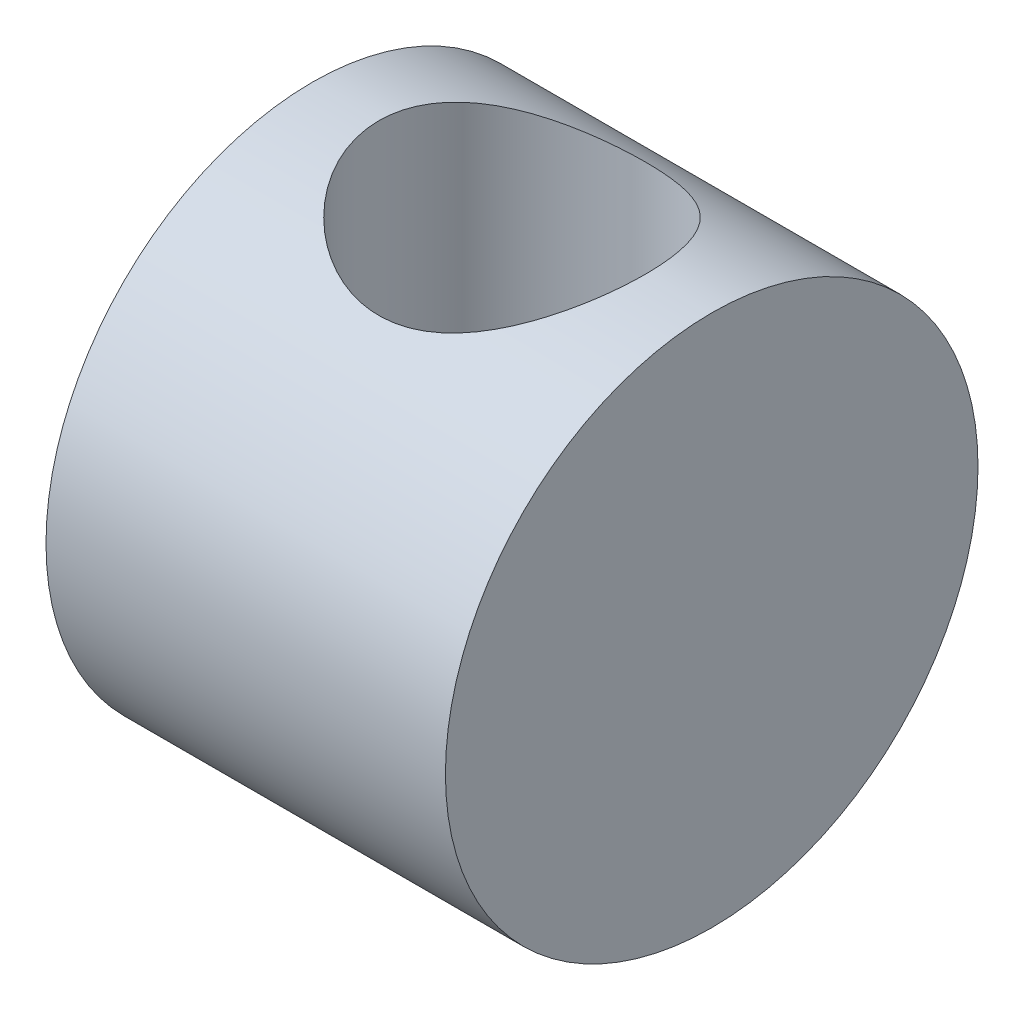
ISO-10303-21;
HEADER;
FILE_DESCRIPTION(('STEP AP214'),'2;1');
FILE_NAME('part.step','',(''),(''),'','','');
FILE_SCHEMA(('AUTOMOTIVE_DESIGN { 1 0 10303 214 1 1 1 1 }'));
ENDSEC;
DATA;
#1=APPLICATION_CONTEXT('core data for automotive mechanical design processes');
#2=APPLICATION_PROTOCOL_DEFINITION('international standard','automotive_design',2000,#1);
#3=PRODUCT_CONTEXT('',#1,'mechanical');
#4=PRODUCT('Part','Part','',(#3));
#5=PRODUCT_RELATED_PRODUCT_CATEGORY('part','',(#4));
#6=PRODUCT_DEFINITION_FORMATION('','',#4);
#7=PRODUCT_DEFINITION_CONTEXT('part definition',#1,'design');
#8=PRODUCT_DEFINITION('design','',#6,#7);
#9=PRODUCT_DEFINITION_SHAPE('','',#8);
#10=(LENGTH_UNIT() NAMED_UNIT(*) SI_UNIT(.MILLI.,.METRE.));
#11=(NAMED_UNIT(*) PLANE_ANGLE_UNIT() SI_UNIT($,.RADIAN.));
#12=(NAMED_UNIT(*) SI_UNIT($,.STERADIAN.) SOLID_ANGLE_UNIT());
#13=UNCERTAINTY_MEASURE_WITH_UNIT(LENGTH_MEASURE(1.E-05),#10,'distance_accuracy_value','');
#14=(GEOMETRIC_REPRESENTATION_CONTEXT(3) GLOBAL_UNCERTAINTY_ASSIGNED_CONTEXT((#13)) GLOBAL_UNIT_ASSIGNED_CONTEXT((#10,
#11,#12)) REPRESENTATION_CONTEXT('',''));
#15=CARTESIAN_POINT('',(0.,0.,0.));
#16=DIRECTION('',(0.,0.,1.));
#17=DIRECTION('',(1.,0.,0.));
#18=AXIS2_PLACEMENT_3D('',#15,#16,#17);
#19=CARTESIAN_POINT('',(75.,0.,0.));
#20=DIRECTION('',(-1.,0.,0.));
#21=DIRECTION('',(0.,0.,1.));
#22=AXIS2_PLACEMENT_3D('',#19,#20,#21);
#23=CYLINDRICAL_SURFACE('',#22,50.);
#24=CARTESIAN_POINT('',(75.,0.,0.));
#25=DIRECTION('',(1.,0.,0.));
#26=DIRECTION('',(0.,0.,-1.));
#27=AXIS2_PLACEMENT_3D('',#24,#25,#26);
#28=CIRCLE('',#27,50.);
#29=CARTESIAN_POINT('',(75.,0.,-50.));
#30=VERTEX_POINT('',#29);
#31=EDGE_CURVE('E10',#30,#30,#28,.T.);
#32=ORIENTED_EDGE('',*,*,#31,.F.);
#33=EDGE_LOOP('',(#32));
#34=FACE_BOUND('',#33,.T.);
#35=CARTESIAN_POINT('',(0.,0.,0.));
#36=DIRECTION('',(1.,0.,0.));
#37=DIRECTION('',(0.,0.,-1.));
#38=AXIS2_PLACEMENT_3D('',#35,#36,#37);
#39=CIRCLE('',#38,50.);
#40=CARTESIAN_POINT('',(0.,0.,-50.));
#41=VERTEX_POINT('',#40);
#42=EDGE_CURVE('E43',#41,#41,#39,.T.);
#43=ORIENTED_EDGE('',*,*,#42,.T.);
#44=EDGE_LOOP('',(#43));
#45=FACE_BOUND('',#44,.T.);
#46=CARTESIAN_POINT('',(37.5,-43.3012701892219,-25.));
#47=CARTESIAN_POINT('',(38.1516577280783,-43.3012738974014,-24.9999972492967));
#48=CARTESIAN_POINT('',(38.803371995286,-43.3160310243838,-24.9744865840936));
#49=CARTESIAN_POINT('',(40.1017786388986,-43.3745117210766,-24.8727781222585));
#50=CARTESIAN_POINT('',(40.7484685354887,-43.4182487761207,-24.7965567281536));
#51=CARTESIAN_POINT('',(42.0327286879632,-43.5331573576326,-24.594261965626));
#52=CARTESIAN_POINT('',(42.6702799970569,-43.6043791614141,-24.4680972258423));
#53=CARTESIAN_POINT('',(43.9304547154474,-43.7716876183493,-24.1675168252073));
#54=CARTESIAN_POINT('',(44.5530795491345,-43.8677718885472,-23.9931057884363));
#55=CARTESIAN_POINT('',(45.7762885876815,-44.0810172919438,-23.599020492088));
#56=CARTESIAN_POINT('',(46.3769729813867,-44.1980627806722,-23.3795936665704));
#57=CARTESIAN_POINT('',(47.5565840143935,-44.450003078188,-22.8969708071432));
#58=CARTESIAN_POINT('',(48.1355102011031,-44.584898258003,-22.6337738633895));
#59=CARTESIAN_POINT('',(49.2687683585691,-44.8687304990091,-22.0657597161742));
#60=CARTESIAN_POINT('',(49.8231060045315,-45.0176642949286,-21.7609521836511));
#61=CARTESIAN_POINT('',(50.905222067322,-45.3258294680467,-21.1115697238676));
#62=CARTESIAN_POINT('',(51.4329906242587,-45.4850646187509,-20.766980187319));
#63=CARTESIAN_POINT('',(52.5020081204318,-45.8233826320238,-20.0100786450758));
#64=CARTESIAN_POINT('',(53.0407899017115,-46.0030202537629,-19.5945268058562));
#65=CARTESIAN_POINT('',(54.0821820892583,-46.365184933611,-18.7214577237365));
#66=CARTESIAN_POINT('',(54.5847906143755,-46.5477121413885,-18.2639383011691));
#67=CARTESIAN_POINT('',(55.5517317034124,-46.9112371384387,-17.3088715339642));
#68=CARTESIAN_POINT('',(56.0160391270901,-47.0922338542696,-16.8112983153376));
#69=CARTESIAN_POINT('',(56.903358645631,-47.4481317438997,-15.778873095701));
#70=CARTESIAN_POINT('',(57.3263845601862,-47.6230349449124,-15.2440336736723));
#71=CARTESIAN_POINT('',(58.1559103346767,-47.9741176674734,-14.101935890209));
#72=CARTESIAN_POINT('',(58.559348132888,-48.1495806286941,-13.4922260925484));
#73=CARTESIAN_POINT('',(59.3130164090103,-48.4839520678333,-12.2363642027715));
#74=CARTESIAN_POINT('',(59.6632438315922,-48.6428595949776,-11.5902100209449));
#75=CARTESIAN_POINT('',(60.3068723133523,-48.9394715219822,-10.2658796175507));
#76=CARTESIAN_POINT('',(60.6003009240628,-49.0771861952305,-9.58771912093296));
#77=CARTESIAN_POINT('',(61.1271574422266,-49.3273633204677,-8.20398216536625));
#78=CARTESIAN_POINT('',(61.3605917227733,-49.4398284545107,-7.49840862763117));
#79=CARTESIAN_POINT('',(61.7500719399282,-49.6290152537626,-6.11654042575089));
#80=CARTESIAN_POINT('',(61.910441753632,-49.7077104710277,-5.44173347042514));
#81=CARTESIAN_POINT('',(62.1748266692845,-49.8380758594528,-4.07858290347346));
#82=CARTESIAN_POINT('',(62.2788442214103,-49.8897472055983,-3.39023988173991));
#83=CARTESIAN_POINT('',(62.4290995504173,-49.9645450119384,-2.0060853632284));
#84=CARTESIAN_POINT('',(62.4753667718625,-49.9876860185287,-1.31027785496802));
#85=CARTESIAN_POINT('',(62.5095715600164,-50.0047839981938,0.0831103975767497));
#86=CARTESIAN_POINT('',(62.4975126954156,-49.9987427567891,0.780691030762016));
#87=CARTESIAN_POINT('',(62.4188401315975,-49.9594597758389,2.11091341143742));
#88=CARTESIAN_POINT('',(62.3570687182852,-49.9286325703957,2.74392012544279));
#89=CARTESIAN_POINT('',(62.1857933574407,-49.8435839162395,4.00180573261866));
#90=CARTESIAN_POINT('',(62.076292770444,-49.789364114565,4.6266851948267));
#91=CARTESIAN_POINT('',(61.8107512890051,-49.6588288150231,5.86411664160767));
#92=CARTESIAN_POINT('',(61.6547088784611,-49.5825125973665,6.47666822390542));
#93=CARTESIAN_POINT('',(61.2976713405259,-49.4095616746076,7.68557846708671));
#94=CARTESIAN_POINT('',(61.0966745985519,-49.3129262397264,8.28193654550033));
#95=CARTESIAN_POINT('',(60.6485341467428,-49.1000532579772,9.46307781020892));
#96=CARTESIAN_POINT('',(60.4007934938713,-48.9835642756784,10.0475888012673));
#97=CARTESIAN_POINT('',(59.8631542092352,-48.7345249487321,11.1932924970822));
#98=CARTESIAN_POINT('',(59.573255627975,-48.6019746233258,11.7544852297725));
#99=CARTESIAN_POINT('',(58.9533967659483,-48.3236126521289,12.8510127622086));
#100=CARTESIAN_POINT('',(58.6234266116358,-48.1777977402037,13.3863411434307));
#101=CARTESIAN_POINT('',(57.9256190341222,-47.8759538475335,14.4287052512528));
#102=CARTESIAN_POINT('',(57.5577785424352,-47.7199240394887,14.9357386800821));
#103=CARTESIAN_POINT('',(56.7498172622248,-47.3857329059287,15.9659829272969));
#104=CARTESIAN_POINT('',(56.3061507663467,-47.2068738780239,16.4861908868765));
#105=CARTESIAN_POINT('',(55.378545130929,-46.845063438937,17.4878151609516));
#106=CARTESIAN_POINT('',(54.8946036999607,-46.6621117953404,17.9692292652126));
#107=CARTESIAN_POINT('',(53.8884818333071,-46.2964642917558,18.8913612335406));
#108=CARTESIAN_POINT('',(53.3662738391005,-46.1137687146198,19.3320492409618));
#109=CARTESIAN_POINT('',(52.5565544991402,-45.843593954014,19.9603840123243));
#110=CARTESIAN_POINT('',(52.2822362181157,-45.7541772399157,20.1643863204588));
#111=CARTESIAN_POINT('',(51.7249760149928,-45.5771884650087,20.5613013775411));
#112=CARTESIAN_POINT('',(51.442031409767,-45.489616992766,20.7542106211332));
#113=CARTESIAN_POINT('',(50.5443742119748,-45.2196491270857,21.3395295271279));
#114=CARTESIAN_POINT('',(49.915048704098,-45.0415831062526,21.7118230929146));
#115=CARTESIAN_POINT('',(48.6225584877746,-44.7026030694781,22.401452093898));
#116=CARTESIAN_POINT('',(47.9593967999659,-44.5416875264198,22.7187924238286));
#117=CARTESIAN_POINT('',(46.9426682570212,-44.3176563216602,23.1510609956445));
#118=CARTESIAN_POINT('',(46.6001600119892,-44.2458813176477,23.2878388705815));
#119=CARTESIAN_POINT('',(45.9083878633344,-44.1087973854835,23.5464514655133));
#120=CARTESIAN_POINT('',(45.5591257107718,-44.043486807495,23.6682900002));
#121=CARTESIAN_POINT('',(44.5020134203325,-43.8582674733307,24.0108330854159));
#122=CARTESIAN_POINT('',(43.7846445728394,-43.749027978065,24.2086472902985));
#123=CARTESIAN_POINT('',(42.3887090134456,-43.5713053774777,24.5269620029075));
#124=CARTESIAN_POINT('',(41.7115687336296,-43.5002796598521,24.6523447935619));
#125=CARTESIAN_POINT('',(40.3466934406897,-43.3894151546965,24.8469575763003));
#126=CARTESIAN_POINT('',(39.6589590285209,-43.3495746047734,24.916190741622));
#127=CARTESIAN_POINT('',(38.2794212125712,-43.3028003096564,24.9973937987513));
#128=CARTESIAN_POINT('',(37.5876205201858,-43.2958466843241,25.0093982853171));
#129=CARTESIAN_POINT('',(36.2058932942095,-43.3150972499872,24.9760435062342));
#130=CARTESIAN_POINT('',(35.5159666372643,-43.3412992028496,24.9306881126047));
#131=CARTESIAN_POINT('',(34.2194474360186,-43.4210793380396,24.7914377927162));
#132=CARTESIAN_POINT('',(33.6120075807608,-43.4713430273842,24.7034064080223));
#133=CARTESIAN_POINT('',(32.4076428039924,-43.5955661816634,24.4835158457237));
#134=CARTESIAN_POINT('',(31.8107169565193,-43.66952354879,24.3516605481936));
#135=CARTESIAN_POINT('',(30.6308400224445,-43.8388445712505,24.0455037172597));
#136=CARTESIAN_POINT('',(30.0478923896639,-43.9342134579594,23.8711918097489));
#137=CARTESIAN_POINT('',(28.8992220322171,-44.1435654387754,23.4817897713769));
#138=CARTESIAN_POINT('',(28.3335003608855,-44.2575496684739,23.2666971526418));
#139=CARTESIAN_POINT('',(27.1963689486826,-44.5066624984352,22.7866934178469));
#140=CARTESIAN_POINT('',(26.6258959734767,-44.6425228592292,22.5199449130062));
#141=CARTESIAN_POINT('',(25.5090705299555,-44.9276158962726,21.9456625079577));
#142=CARTESIAN_POINT('',(24.9627285116735,-45.0768542828119,21.6381111642824));
#143=CARTESIAN_POINT('',(23.8965059695428,-45.3849587766745,20.9841879069052));
#144=CARTESIAN_POINT('',(23.3766307737208,-45.5438268085479,20.6378082212681));
#145=CARTESIAN_POINT('',(22.3654120849964,-45.8674857084529,19.9081156666699));
#146=CARTESIAN_POINT('',(21.874070627864,-46.0322769977309,19.5248001676595));
#147=CARTESIAN_POINT('',(20.8616989877569,-46.3851314469512,18.6723933753344));
#148=CARTESIAN_POINT('',(20.3447428254896,-46.573507868278,18.1985814957771));
#149=CARTESIAN_POINT('',(19.3520387322257,-46.9482395083491,17.208801457832));
#150=CARTESIAN_POINT('',(18.8762939785701,-47.1345945702822,16.6928300549538));
#151=CARTESIAN_POINT('',(17.9686174572794,-47.500551032776,15.6210867099589));
#152=CARTESIAN_POINT('',(17.5367011798194,-47.6801500315453,15.0653008138923));
#153=CARTESIAN_POINT('',(16.71978349862,-48.0279167170746,13.9168654136766));
#154=CARTESIAN_POINT('',(16.3347816332774,-48.1960845163019,13.324216272321));
#155=CARTESIAN_POINT('',(15.6051614835791,-48.5208655173557,12.0890056860871));
#156=CARTESIAN_POINT('',(15.2618859333067,-48.6770536851778,11.445537083859));
#157=CARTESIAN_POINT('',(14.6313225332882,-48.9683386405048,10.1270695634352));
#158=CARTESIAN_POINT('',(14.3440365599551,-49.1034347211076,9.45206958944887));
#159=CARTESIAN_POINT('',(13.8289190530291,-49.3484422850348,8.07584855033877));
#160=CARTESIAN_POINT('',(13.6010450481311,-49.4583717521001,7.3746466282172));
#161=CARTESIAN_POINT('',(13.2074523325325,-49.6497556882263,5.9512332801707));
#162=CARTESIAN_POINT('',(13.041726251363,-49.7312135338177,5.2290243565372));
#163=CARTESIAN_POINT('',(12.7870261729531,-49.8569959046632,3.83701251064258));
#164=CARTESIAN_POINT('',(12.6924033315753,-49.9040426202125,3.16848428122955));
#165=CARTESIAN_POINT('',(12.5575332527149,-49.9712236366136,1.82462999197065));
#166=CARTESIAN_POINT('',(12.5172825642458,-49.9913596454803,1.14930436629496));
#167=CARTESIAN_POINT('',(12.4916837635048,-50.0041574921416,-0.202439854909058));
#168=CARTESIAN_POINT('',(12.5063192941496,-49.996827515296,-0.878858064769204));
#169=CARTESIAN_POINT('',(12.5902641777621,-49.954915747023,-2.22742891911759));
#170=CARTESIAN_POINT('',(12.6595720256024,-49.9203347058167,-2.89958168052));
#171=CARTESIAN_POINT('',(12.8456001975214,-49.8280383988319,-4.19012849545484));
#172=CARTESIAN_POINT('',(12.9588883942171,-49.7720011161012,-4.80914210853196));
#173=CARTESIAN_POINT('',(13.2311437647007,-49.638325111347,-6.03461366863557));
#174=CARTESIAN_POINT('',(13.390108359697,-49.5606876088334,-6.64107232241653));
#175=CARTESIAN_POINT('',(13.752150005338,-49.3855777801893,-7.83775931737803));
#176=CARTESIAN_POINT('',(13.9552304852864,-49.2881039121362,-8.42798639279269));
#177=CARTESIAN_POINT('',(14.4036602637829,-49.0754720301766,-9.5888648262004));
#178=CARTESIAN_POINT('',(14.6490115350773,-48.9603131909529,-10.1595152690755));
#179=CARTESIAN_POINT('',(15.191340635116,-48.7095065616211,-11.3022392748832));
#180=CARTESIAN_POINT('',(15.4900762338169,-48.5731936311759,-11.8733321215653));
#181=CARTESIAN_POINT('',(16.1290248273622,-48.2870272685357,-12.9882367601858));
#182=CARTESIAN_POINT('',(16.469238598444,-48.1371735829479,-13.5320480412983));
#183=CARTESIAN_POINT('',(17.1889854959147,-47.82710328795,-14.5901418631954));
#184=CARTESIAN_POINT('',(17.5685321170351,-47.6668831290299,-15.1044141747537));
#185=CARTESIAN_POINT('',(18.364673133882,-47.3395085084327,-16.1011229628171));
#186=CARTESIAN_POINT('',(18.7812708740803,-47.1723534214926,-16.5835565584941));
#187=CARTESIAN_POINT('',(19.6926539441099,-46.8178193567662,-17.5609868614201));
#188=CARTESIAN_POINT('',(20.1910942188869,-46.630083800416,-18.0524521311882));
#189=CARTESIAN_POINT('',(21.2275885147761,-46.2553556901095,-18.9920498989603));
#190=CARTESIAN_POINT('',(21.7656454384637,-46.0683631916544,-19.4401792163128));
#191=CARTESIAN_POINT('',(22.8792214076898,-45.7000088573962,-20.2909910624585));
#192=CARTESIAN_POINT('',(23.4547747865264,-45.5186524130989,-20.6936309903305));
#193=CARTESIAN_POINT('',(24.640212274829,-45.1669568158024,-21.4504110417563));
#194=CARTESIAN_POINT('',(25.2500937497663,-44.9966168194903,-21.8045548800276));
#195=CARTESIAN_POINT('',(26.1981392814772,-44.7508086460529,-22.3024856266454));
#196=CARTESIAN_POINT('',(26.5249666879001,-44.6693211671637,-22.4651334968817));
#197=CARTESIAN_POINT('',(27.1863570276082,-44.5114376206163,-22.7763547859923));
#198=CARTESIAN_POINT('',(27.5209181550612,-44.4350403802383,-22.9249314500231));
#199=CARTESIAN_POINT('',(28.5357385547778,-44.2145039056118,-23.3490772961765));
#200=CARTESIAN_POINT('',(29.2271164048667,-44.0790247669708,-23.6030526309905));
#201=CARTESIAN_POINT('',(30.6320570638723,-43.8370978970742,-24.0493909122374));
#202=CARTESIAN_POINT('',(31.3455486397945,-43.7305659487763,-24.2419328799137));
#203=CARTESIAN_POINT('',(32.7904560509093,-43.5507401419656,-24.5635340961408));
#204=CARTESIAN_POINT('',(33.5218589771479,-43.4774230473757,-24.6926377295426));
#205=CARTESIAN_POINT('',(34.794990170201,-43.3823768905292,-24.8591156657607));
#206=CARTESIAN_POINT('',(35.3341211493919,-43.3520358806036,-24.91189663269));
#207=CARTESIAN_POINT('',(36.4154882316478,-43.3114803138654,-24.9823411189456));
#208=CARTESIAN_POINT('',(36.9577245400057,-43.301267103469,-25.0000022889913));
#209=CARTESIAN_POINT('',(37.5,-43.3012701892219,-25.));
#210=B_SPLINE_CURVE_WITH_KNOTS('',3,(#46,#47,#48,#49,#50,#51,#52,#53,#54,#55,#56,#57,#58,#59,
#60,#61,#62,#63,#64,#65,#66,#67,#68,#69,#70,#71,#72,#73,#74,#75,#76,#77,#78,#79,#80,#81,#82,#83,
#84,#85,#86,#87,#88,#89,#90,#91,#92,#93,#94,#95,#96,#97,#98,#99,#100,#101,#102,#103,#104,#105,
#106,#107,#108,#109,#110,#111,#112,#113,#114,#115,#116,#117,#118,#119,#120,#121,#122,#123,#124,
#125,#126,#127,#128,#129,#130,#131,#132,#133,#134,#135,#136,#137,#138,#139,#140,#141,#142,#143,
#144,#145,#146,#147,#148,#149,#150,#151,#152,#153,#154,#155,#156,#157,#158,#159,#160,#161,#162,
#163,#164,#165,#166,#167,#168,#169,#170,#171,#172,#173,#174,#175,#176,#177,#178,#179,#180,#181,
#182,#183,#184,#185,#186,#187,#188,#189,#190,#191,#192,#193,#194,#195,#196,#197,#198,#199,#200,
#201,#202,#203,#204,#205,#206,#207,#208,#209),.UNSPECIFIED.,.T.,.F.,(4,2,2,2,2,2,2,2,2,2,2,2,2,
2,2,2,2,2,2,2,2,2,2,2,2,2,2,2,2,2,2,2,2,2,2,2,2,2,2,2,2,2,2,2,2,2,2,2,2,2,2,2,2,2,2,2,2,2,2,2,2,
2,2,2,2,2,2,2,2,2,2,2,2,2,2,2,2,2,2,2,2,4),(0.,1.95441192278272,3.90973393836879,
5.86864987236744,7.82737812256329,9.7756153845597,11.723893149394,13.6717188730885,
15.620262192923,17.7292201070748,19.8382876161037,21.9487286473746,24.0584607311283,
26.3111473362998,28.5639632414418,30.8156836143288,33.067164691916,35.1584826548101,
37.2497096806103,39.339870037992,41.4299025102114,43.3379272290007,45.2458176284876,
47.153770184371,49.0617912774174,50.9960675392925,52.9303414839626,54.8650930001225,
56.8000014052271,58.9178481891629,61.035815549757,63.1553234931732,64.2151556831173,
65.2753209551758,67.5299925667647,69.7844632493247,70.9112804180446,72.0378092573375,
74.2902273803598,76.3642610710996,78.438177541809,80.5108401701135,82.5833628929462,
84.4287799170669,86.2740335954544,88.1197386074929,89.965556255128,91.8963352398347,
93.8279423204728,95.7599367269954,97.6920688048029,99.8679420645493,102.043982932003,
104.220790212283,106.39757607266,108.632125578475,110.866749959239,113.099772486652,
115.332530103652,117.360339064742,119.388019315274,121.415095328543,123.442115538416,
125.335316614567,127.228410825634,129.121652247157,131.014982048795,132.989197931268,
134.9634507656,136.938383204219,138.913494094206,141.085252835438,143.257170852589,
145.431106304714,147.604875143848,148.726679825932,149.848225159809,152.091379766987,
154.327936660809,156.562926503801,158.1891770497,159.815536377274),.UNSPECIFIED.);
#211=CARTESIAN_POINT('',(37.5,-43.3012701892219,-25.));
#212=VERTEX_POINT('',#211);
#213=EDGE_CURVE('E49',#212,#212,#210,.T.);
#214=ORIENTED_EDGE('',*,*,#213,.F.);
#215=EDGE_LOOP('',(#214));
#216=FACE_BOUND('',#215,.T.);
#217=CARTESIAN_POINT('',(37.5,43.3012701892219,-25.));
#218=CARTESIAN_POINT('',(36.8483422719217,43.3012738974014,-24.9999972492967));
#219=CARTESIAN_POINT('',(36.196628004714,43.3160310243838,-24.9744865840936));
#220=CARTESIAN_POINT('',(34.8982213611014,43.3745117210766,-24.8727781222585));
#221=CARTESIAN_POINT('',(34.2515314645113,43.4182487761207,-24.7965567281536));
#222=CARTESIAN_POINT('',(32.9672713120368,43.5331573576326,-24.594261965626));
#223=CARTESIAN_POINT('',(32.3297200029431,43.6043791614141,-24.4680972258423));
#224=CARTESIAN_POINT('',(31.0695452845526,43.7716876183493,-24.1675168252073));
#225=CARTESIAN_POINT('',(30.4469204508655,43.8677718885472,-23.9931057884363));
#226=CARTESIAN_POINT('',(29.2237114123185,44.0810172919438,-23.599020492088));
#227=CARTESIAN_POINT('',(28.6230270186133,44.1980627806722,-23.3795936665704));
#228=CARTESIAN_POINT('',(27.4434159856065,44.450003078188,-22.8969708071432));
#229=CARTESIAN_POINT('',(26.8644897988969,44.584898258003,-22.6337738633895));
#230=CARTESIAN_POINT('',(25.7312316414309,44.8687304990091,-22.0657597161742));
#231=CARTESIAN_POINT('',(25.1768939954685,45.0176642949286,-21.7609521836511));
#232=CARTESIAN_POINT('',(24.094777932678,45.3258294680467,-21.1115697238676));
#233=CARTESIAN_POINT('',(23.5670093757413,45.4850646187509,-20.766980187319));
#234=CARTESIAN_POINT('',(22.4979918795682,45.8233826320238,-20.0100786450758));
#235=CARTESIAN_POINT('',(21.9592100982885,46.0030202537629,-19.5945268058562));
#236=CARTESIAN_POINT('',(20.9178179107417,46.365184933611,-18.7214577237365));
#237=CARTESIAN_POINT('',(20.4152093856245,46.5477121413885,-18.2639383011691));
#238=CARTESIAN_POINT('',(19.4482682965876,46.9112371384387,-17.3088715339642));
#239=CARTESIAN_POINT('',(18.9839608729099,47.0922338542696,-16.8112983153376));
#240=CARTESIAN_POINT('',(18.096641354369,47.4481317438997,-15.778873095701));
#241=CARTESIAN_POINT('',(17.6736154398138,47.6230349449123,-15.2440336736723));
#242=CARTESIAN_POINT('',(16.8440896653232,47.9741176674734,-14.101935890209));
#243=CARTESIAN_POINT('',(16.440651867112,48.1495806286941,-13.4922260925484));
#244=CARTESIAN_POINT('',(15.6869835909897,48.4839520678333,-12.2363642027715));
#245=CARTESIAN_POINT('',(15.3367561684078,48.6428595949776,-11.5902100209449));
#246=CARTESIAN_POINT('',(14.6931276866477,48.9394715219822,-10.2658796175507));
#247=CARTESIAN_POINT('',(14.3996990759372,49.0771861952305,-9.58771912093295));
#248=CARTESIAN_POINT('',(13.8728425577734,49.3273633204677,-8.20398216536624));
#249=CARTESIAN_POINT('',(13.6394082772267,49.4398284545107,-7.49840862763115));
#250=CARTESIAN_POINT('',(13.2499280600718,49.6290152537626,-6.11654042575088));
#251=CARTESIAN_POINT('',(13.089558246368,49.7077104710277,-5.44173347042512));
#252=CARTESIAN_POINT('',(12.8251733307155,49.8380758594528,-4.07858290347344));
#253=CARTESIAN_POINT('',(12.7211557785896,49.8897472055983,-3.39023988173989));
#254=CARTESIAN_POINT('',(12.5709004495827,49.9645450119384,-2.00608536322838));
#255=CARTESIAN_POINT('',(12.5246332281375,49.9876860185287,-1.310277854968));
#256=CARTESIAN_POINT('',(12.4904284399836,50.0047839981938,0.0831103975767619));
#257=CARTESIAN_POINT('',(12.5024873045844,49.9987427567891,0.780691030762027));
#258=CARTESIAN_POINT('',(12.5811598684025,49.9594597758389,2.11091341143743));
#259=CARTESIAN_POINT('',(12.6429312817148,49.9286325703957,2.7439201254428));
#260=CARTESIAN_POINT('',(12.8142066425593,49.8435839162395,4.00180573261866));
#261=CARTESIAN_POINT('',(12.923707229556,49.789364114565,4.62668519482671));
#262=CARTESIAN_POINT('',(13.1892487109949,49.6588288150231,5.86411664160768));
#263=CARTESIAN_POINT('',(13.3452911215389,49.5825125973665,6.47666822390543));
#264=CARTESIAN_POINT('',(13.7023286594741,49.4095616746076,7.68557846708672));
#265=CARTESIAN_POINT('',(13.9033254014481,49.3129262397264,8.28193654550033));
#266=CARTESIAN_POINT('',(14.3514658532572,49.1000532579772,9.46307781020893));
#267=CARTESIAN_POINT('',(14.5992065061287,48.9835642756784,10.0475888012673));
#268=CARTESIAN_POINT('',(15.1368457907648,48.7345249487321,11.1932924970822));
#269=CARTESIAN_POINT('',(15.426744372025,48.6019746233258,11.7544852297725));
#270=CARTESIAN_POINT('',(16.0466032340517,48.3236126521289,12.8510127622086));
#271=CARTESIAN_POINT('',(16.3765733883642,48.1777977402037,13.3863411434307));
#272=CARTESIAN_POINT('',(17.0743809658778,47.8759538475335,14.4287052512528));
#273=CARTESIAN_POINT('',(17.4422214575648,47.7199240394887,14.9357386800821));
#274=CARTESIAN_POINT('',(18.2501827377752,47.3857329059286,15.965982927297));
#275=CARTESIAN_POINT('',(18.6938492336533,47.2068738780239,16.4861908868765));
#276=CARTESIAN_POINT('',(19.621454869071,46.845063438937,17.4878151609516));
#277=CARTESIAN_POINT('',(20.1053963000393,46.6621117953404,17.9692292652126));
#278=CARTESIAN_POINT('',(21.1115181666929,46.2964642917558,18.8913612335407));
#279=CARTESIAN_POINT('',(21.6337261608995,46.1137687146198,19.3320492409618));
#280=CARTESIAN_POINT('',(22.4434455008599,45.843593954014,19.9603840123244));
#281=CARTESIAN_POINT('',(22.7177637818843,45.7541772399157,20.1643863204588));
#282=CARTESIAN_POINT('',(23.2750239850072,45.5771884650087,20.5613013775411));
#283=CARTESIAN_POINT('',(23.557968590233,45.489616992766,20.7542106211332));
#284=CARTESIAN_POINT('',(24.4556257880252,45.2196491270857,21.3395295271279));
#285=CARTESIAN_POINT('',(25.084951295902,45.0415831062526,21.7118230929146));
#286=CARTESIAN_POINT('',(26.3774415122254,44.7026030694781,22.401452093898));
#287=CARTESIAN_POINT('',(27.0406032000341,44.5416875264198,22.7187924238286));
#288=CARTESIAN_POINT('',(28.0573317429788,44.3176563216602,23.1510609956445));
#289=CARTESIAN_POINT('',(28.3998399880108,44.2458813176477,23.2878388705815));
#290=CARTESIAN_POINT('',(29.0916121366656,44.1087973854835,23.5464514655133));
#291=CARTESIAN_POINT('',(29.4408742892282,44.043486807495,23.6682900002));
#292=CARTESIAN_POINT('',(30.4979865796675,43.8582674733307,24.010833085416));
#293=CARTESIAN_POINT('',(31.2153554271606,43.749027978065,24.2086472902985));
#294=CARTESIAN_POINT('',(32.6112909865544,43.5713053774777,24.5269620029075));
#295=CARTESIAN_POINT('',(33.2884312663704,43.5002796598521,24.6523447935619));
#296=CARTESIAN_POINT('',(34.6533065593103,43.3894151546965,24.8469575763003));
#297=CARTESIAN_POINT('',(35.3410409714792,43.3495746047734,24.916190741622));
#298=CARTESIAN_POINT('',(36.7205787874288,43.3028003096564,24.9973937987513));
#299=CARTESIAN_POINT('',(37.4123794798142,43.2958466843241,25.0093982853171));
#300=CARTESIAN_POINT('',(38.7941067057905,43.3150972499872,24.9760435062342));
#301=CARTESIAN_POINT('',(39.4840333627357,43.3412992028496,24.9306881126047));
#302=CARTESIAN_POINT('',(40.7805525639814,43.4210793380396,24.7914377927162));
#303=CARTESIAN_POINT('',(41.3879924192392,43.4713430273842,24.7034064080223));
#304=CARTESIAN_POINT('',(42.5923571960076,43.5955661816634,24.4835158457237));
#305=CARTESIAN_POINT('',(43.1892830434807,43.66952354879,24.3516605481936));
#306=CARTESIAN_POINT('',(44.3691599775555,43.8388445712505,24.0455037172596));
#307=CARTESIAN_POINT('',(44.9521076103361,43.9342134579594,23.8711918097489));
#308=CARTESIAN_POINT('',(46.1007779677829,44.1435654387754,23.4817897713769));
#309=CARTESIAN_POINT('',(46.6664996391145,44.2575496684739,23.2666971526418));
#310=CARTESIAN_POINT('',(47.8036310513174,44.5066624984352,22.7866934178469));
#311=CARTESIAN_POINT('',(48.3741040265232,44.6425228592292,22.5199449130062));
#312=CARTESIAN_POINT('',(49.4909294700445,44.9276158962726,21.9456625079577));
#313=CARTESIAN_POINT('',(50.0372714883265,45.0768542828119,21.6381111642824));
#314=CARTESIAN_POINT('',(51.1034940304572,45.3849587766745,20.9841879069052));
#315=CARTESIAN_POINT('',(51.6233692262792,45.5438268085479,20.6378082212681));
#316=CARTESIAN_POINT('',(52.6345879150036,45.8674857084529,19.9081156666699));
#317=CARTESIAN_POINT('',(53.125929372136,46.0322769977309,19.5248001676595));
#318=CARTESIAN_POINT('',(54.1383010122431,46.3851314469512,18.6723933753344));
#319=CARTESIAN_POINT('',(54.6552571745104,46.573507868278,18.1985814957771));
#320=CARTESIAN_POINT('',(55.6479612677743,46.9482395083491,17.208801457832));
#321=CARTESIAN_POINT('',(56.1237060214299,47.1345945702822,16.6928300549538));
#322=CARTESIAN_POINT('',(57.0313825427206,47.500551032776,15.6210867099589));
#323=CARTESIAN_POINT('',(57.4632988201806,47.6801500315453,15.0653008138923));
#324=CARTESIAN_POINT('',(58.28021650138,48.0279167170745,13.9168654136766));
#325=CARTESIAN_POINT('',(58.6652183667226,48.1960845163019,13.324216272321));
#326=CARTESIAN_POINT('',(59.3948385164209,48.5208655173557,12.0890056860871));
#327=CARTESIAN_POINT('',(59.7381140666933,48.6770536851778,11.445537083859));
#328=CARTESIAN_POINT('',(60.3686774667118,48.9683386405048,10.1270695634352));
#329=CARTESIAN_POINT('',(60.6559634400449,49.1034347211076,9.45206958944887));
#330=CARTESIAN_POINT('',(61.1710809469709,49.3484422850348,8.07584855033876));
#331=CARTESIAN_POINT('',(61.3989549518689,49.4583717521001,7.3746466282172));
#332=CARTESIAN_POINT('',(61.7925476674675,49.6497556882263,5.9512332801707));
#333=CARTESIAN_POINT('',(61.958273748637,49.7312135338177,5.2290243565372));
#334=CARTESIAN_POINT('',(62.2129738270469,49.8569959046632,3.83701251064258));
#335=CARTESIAN_POINT('',(62.3075966684247,49.9040426202125,3.16848428122954));
#336=CARTESIAN_POINT('',(62.4424667472851,49.9712236366136,1.82462999197065));
#337=CARTESIAN_POINT('',(62.4827174357542,49.9913596454803,1.14930436629496));
#338=CARTESIAN_POINT('',(62.5083162364952,50.0041574921416,-0.202439854909061));
#339=CARTESIAN_POINT('',(62.4936807058504,49.996827515296,-0.878858064769207));
#340=CARTESIAN_POINT('',(62.4097358222379,49.954915747023,-2.22742891911759));
#341=CARTESIAN_POINT('',(62.3404279743976,49.9203347058167,-2.89958168052));
#342=CARTESIAN_POINT('',(62.1543998024786,49.8280383988319,-4.19012849545485));
#343=CARTESIAN_POINT('',(62.0411116057829,49.7720011161012,-4.80914210853197));
#344=CARTESIAN_POINT('',(61.7688562352993,49.638325111347,-6.03461366863558));
#345=CARTESIAN_POINT('',(61.609891640303,49.5606876088334,-6.64107232241653));
#346=CARTESIAN_POINT('',(61.247849994662,49.3855777801893,-7.83775931737803));
#347=CARTESIAN_POINT('',(61.0447695147136,49.2881039121362,-8.42798639279269));
#348=CARTESIAN_POINT('',(60.5963397362171,49.0754720301766,-9.5888648262004));
#349=CARTESIAN_POINT('',(60.3509884649227,48.9603131909529,-10.1595152690755));
#350=CARTESIAN_POINT('',(59.808659364884,48.7095065616211,-11.3022392748832));
#351=CARTESIAN_POINT('',(59.5099237661831,48.5731936311759,-11.8733321215653));
#352=CARTESIAN_POINT('',(58.8709751726378,48.2870272685357,-12.9882367601858));
#353=CARTESIAN_POINT('',(58.530761401556,48.1371735829479,-13.5320480412983));
#354=CARTESIAN_POINT('',(57.8110145040853,47.82710328795,-14.5901418631954));
#355=CARTESIAN_POINT('',(57.4314678829649,47.6668831290299,-15.1044141747537));
#356=CARTESIAN_POINT('',(56.635326866118,47.3395085084327,-16.1011229628171));
#357=CARTESIAN_POINT('',(56.2187291259197,47.1723534214926,-16.5835565584941));
#358=CARTESIAN_POINT('',(55.3073460558901,46.8178193567662,-17.5609868614201));
#359=CARTESIAN_POINT('',(54.8089057811131,46.630083800416,-18.0524521311882));
#360=CARTESIAN_POINT('',(53.7724114852239,46.2553556901095,-18.9920498989603));
#361=CARTESIAN_POINT('',(53.2343545615363,46.0683631916544,-19.4401792163128));
#362=CARTESIAN_POINT('',(52.1207785923102,45.7000088573962,-20.2909910624585));
#363=CARTESIAN_POINT('',(51.5452252134736,45.5186524130989,-20.6936309903305));
#364=CARTESIAN_POINT('',(50.359787725171,45.1669568158024,-21.4504110417563));
#365=CARTESIAN_POINT('',(49.7499062502337,44.9966168194902,-21.8045548800276));
#366=CARTESIAN_POINT('',(48.8018607185228,44.7508086460529,-22.3024856266454));
#367=CARTESIAN_POINT('',(48.4750333120999,44.6693211671637,-22.4651334968817));
#368=CARTESIAN_POINT('',(47.8136429723918,44.5114376206163,-22.7763547859923));
#369=CARTESIAN_POINT('',(47.4790818449388,44.4350403802383,-22.9249314500231));
#370=CARTESIAN_POINT('',(46.4642614452222,44.2145039056118,-23.3490772961765));
#371=CARTESIAN_POINT('',(45.7728835951333,44.0790247669708,-23.6030526309905));
#372=CARTESIAN_POINT('',(44.3679429361277,43.8370978970742,-24.0493909122374));
#373=CARTESIAN_POINT('',(43.6544513602055,43.7305659487763,-24.2419328799137));
#374=CARTESIAN_POINT('',(42.2095439490907,43.5507401419656,-24.5635340961408));
#375=CARTESIAN_POINT('',(41.4781410228521,43.4774230473757,-24.6926377295426));
#376=CARTESIAN_POINT('',(40.205009829799,43.3823768905292,-24.8591156657607));
#377=CARTESIAN_POINT('',(39.6658788506081,43.3520358806036,-24.91189663269));
#378=CARTESIAN_POINT('',(38.5845117683522,43.3114803138654,-24.9823411189456));
#379=CARTESIAN_POINT('',(38.0422754599943,43.301267103469,-25.0000022889913));
#380=CARTESIAN_POINT('',(37.5,43.3012701892219,-25.));
#381=B_SPLINE_CURVE_WITH_KNOTS('',3,(#217,#218,#219,#220,#221,#222,#223,#224,#225,#226,#227,
#228,#229,#230,#231,#232,#233,#234,#235,#236,#237,#238,#239,#240,#241,#242,#243,#244,#245,#246,
#247,#248,#249,#250,#251,#252,#253,#254,#255,#256,#257,#258,#259,#260,#261,#262,#263,#264,#265,
#266,#267,#268,#269,#270,#271,#272,#273,#274,#275,#276,#277,#278,#279,#280,#281,#282,#283,#284,
#285,#286,#287,#288,#289,#290,#291,#292,#293,#294,#295,#296,#297,#298,#299,#300,#301,#302,#303,
#304,#305,#306,#307,#308,#309,#310,#311,#312,#313,#314,#315,#316,#317,#318,#319,#320,#321,#322,
#323,#324,#325,#326,#327,#328,#329,#330,#331,#332,#333,#334,#335,#336,#337,#338,#339,#340,#341,
#342,#343,#344,#345,#346,#347,#348,#349,#350,#351,#352,#353,#354,#355,#356,#357,#358,#359,#360,
#361,#362,#363,#364,#365,#366,#367,#368,#369,#370,#371,#372,#373,#374,#375,#376,#377,#378,#379,
#380),.UNSPECIFIED.,.T.,.F.,(4,2,2,2,2,2,2,2,2,2,2,2,2,2,2,2,2,2,2,2,2,2,2,2,2,2,2,2,2,2,2,2,2,
2,2,2,2,2,2,2,2,2,2,2,2,2,2,2,2,2,2,2,2,2,2,2,2,2,2,2,2,2,2,2,2,2,2,2,2,2,2,2,2,2,2,2,2,2,2,2,2,
4),(0.,1.95441192278272,3.90973393836879,5.86864987236744,7.8273781225633,9.77561538455969,
11.723893149394,13.6717188730885,15.620262192923,17.7292201070748,19.8382876161037,
21.9487286473746,24.0584607311283,26.3111473362998,28.5639632414418,30.8156836143288,
33.067164691916,35.1584826548101,37.2497096806103,39.339870037992,41.4299025102114,
43.3379272290007,45.2458176284876,47.153770184371,49.0617912774175,50.9960675392925,
52.9303414839626,54.8650930001226,56.8000014052271,58.9178481891629,61.0358155497571,
63.1553234931732,64.2151556831173,65.2753209551759,67.5299925667647,69.7844632493247,
70.9112804180446,72.0378092573376,74.2902273803598,76.3642610710997,78.4381775418091,
80.5108401701136,82.5833628929462,84.4287799170669,86.2740335954545,88.1197386074929,
89.9655562551281,91.8963352398348,93.8279423204728,95.7599367269954,97.6920688048029,
99.8679420645494,102.043982932003,104.220790212283,106.39757607266,108.632125578475,
110.866749959239,113.099772486652,115.332530103652,117.360339064742,119.388019315274,
121.415095328543,123.442115538416,125.335316614567,127.228410825634,129.121652247157,
131.014982048795,132.989197931268,134.9634507656,136.938383204219,138.913494094206,
141.085252835438,143.257170852589,145.431106304714,147.604875143848,148.726679825932,
149.848225159809,152.091379766987,154.327936660809,156.562926503801,158.1891770497,
159.815536377274),.UNSPECIFIED.);
#382=CARTESIAN_POINT('',(37.5,43.3012701892219,-25.));
#383=VERTEX_POINT('',#382);
#384=EDGE_CURVE('E35',#383,#383,#381,.T.);
#385=ORIENTED_EDGE('',*,*,#384,.F.);
#386=EDGE_LOOP('',(#385));
#387=FACE_BOUND('',#386,.T.);
#388=ADVANCED_FACE('F31',(#34,#45,#216,#387),#23,.T.);
#389=CARTESIAN_POINT('',(75.,0.,0.));
#390=DIRECTION('',(1.,0.,0.));
#391=DIRECTION('',(0.,0.,-1.));
#392=AXIS2_PLACEMENT_3D('',#389,#390,#391);
#393=PLANE('',#392);
#394=ORIENTED_EDGE('',*,*,#31,.T.);
#395=EDGE_LOOP('',(#394));
#396=FACE_BOUND('',#395,.T.);
#397=ADVANCED_FACE('F60',(#396),#393,.T.);
#398=CARTESIAN_POINT('',(0.,0.,0.));
#399=DIRECTION('',(1.,0.,0.));
#400=DIRECTION('',(0.,0.,-1.));
#401=AXIS2_PLACEMENT_3D('',#398,#399,#400);
#402=PLANE('',#401);
#403=ORIENTED_EDGE('',*,*,#42,.F.);
#404=EDGE_LOOP('',(#403));
#405=FACE_BOUND('',#404,.T.);
#406=ADVANCED_FACE('F58',(#405),#402,.F.);
#407=CARTESIAN_POINT('',(37.5,100.,0.));
#408=DIRECTION('',(0.,-1.,0.));
#409=DIRECTION('',(0.,0.,-1.));
#410=AXIS2_PLACEMENT_3D('',#407,#408,#409);
#411=CYLINDRICAL_SURFACE('',#410,25.);
#412=ORIENTED_EDGE('',*,*,#213,.T.);
#413=EDGE_LOOP('',(#412));
#414=FACE_BOUND('',#413,.T.);
#415=ORIENTED_EDGE('',*,*,#384,.T.);
#416=EDGE_LOOP('',(#415));
#417=FACE_BOUND('',#416,.T.);
#418=ADVANCED_FACE('F54',(#414,#417),#411,.F.);
#419=CLOSED_SHELL('',(#388,#397,#406,#418));
#420=MANIFOLD_SOLID_BREP('B2',#419);
#421=ADVANCED_BREP_SHAPE_REPRESENTATION('',(#18,#420),#14);
#422=SHAPE_DEFINITION_REPRESENTATION(#9,#421);
ENDSEC;
END-ISO-10303-21;
